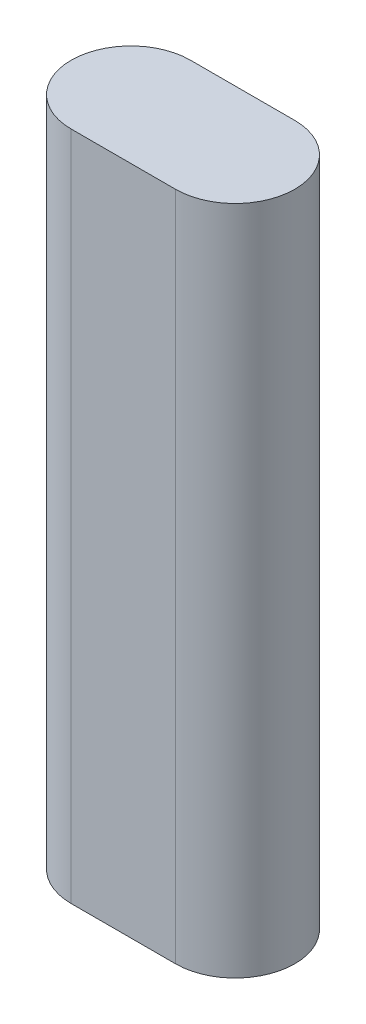
ISO-10303-21;
HEADER;
FILE_DESCRIPTION(('STEP AP214'),'2;1');
FILE_NAME('part.step','',(''),(''),'','','');
FILE_SCHEMA(('AUTOMOTIVE_DESIGN { 1 0 10303 214 1 1 1 1 }'));
ENDSEC;
DATA;
#1=APPLICATION_CONTEXT('core data for automotive mechanical design processes');
#2=APPLICATION_PROTOCOL_DEFINITION('international standard','automotive_design',2000,#1);
#3=PRODUCT_CONTEXT('',#1,'mechanical');
#4=PRODUCT('Part','Part','',(#3));
#5=PRODUCT_RELATED_PRODUCT_CATEGORY('part','',(#4));
#6=PRODUCT_DEFINITION_FORMATION('','',#4);
#7=PRODUCT_DEFINITION_CONTEXT('part definition',#1,'design');
#8=PRODUCT_DEFINITION('design','',#6,#7);
#9=PRODUCT_DEFINITION_SHAPE('','',#8);
#10=(LENGTH_UNIT() NAMED_UNIT(*) SI_UNIT(.MILLI.,.METRE.));
#11=(NAMED_UNIT(*) PLANE_ANGLE_UNIT() SI_UNIT($,.RADIAN.));
#12=(NAMED_UNIT(*) SI_UNIT($,.STERADIAN.) SOLID_ANGLE_UNIT());
#13=UNCERTAINTY_MEASURE_WITH_UNIT(LENGTH_MEASURE(1.E-05),#10,'distance_accuracy_value','');
#14=(GEOMETRIC_REPRESENTATION_CONTEXT(3) GLOBAL_UNCERTAINTY_ASSIGNED_CONTEXT((#13)) GLOBAL_UNIT_ASSIGNED_CONTEXT((#10,
#11,#12)) REPRESENTATION_CONTEXT('',''));
#15=CARTESIAN_POINT('',(0.,0.,0.));
#16=DIRECTION('',(0.,0.,1.));
#17=DIRECTION('',(1.,0.,0.));
#18=AXIS2_PLACEMENT_3D('',#15,#16,#17);
#19=CARTESIAN_POINT('',(-10.5,135.,0.));
#20=DIRECTION('',(0.,-1.,0.));
#21=DIRECTION('',(0.,0.,-1.));
#22=AXIS2_PLACEMENT_3D('',#19,#20,#21);
#23=CYLINDRICAL_SURFACE('',#22,12.);
#24=CARTESIAN_POINT('',(-10.5,0.,0.));
#25=DIRECTION('',(0.,1.,0.));
#26=DIRECTION('',(0.,0.,1.));
#27=AXIS2_PLACEMENT_3D('',#24,#25,#26);
#28=CIRCLE('',#27,12.);
#29=CARTESIAN_POINT('',(-10.5,0.,-12.));
#30=VERTEX_POINT('',#29);
#31=CARTESIAN_POINT('',(-10.5,0.,12.));
#32=VERTEX_POINT('',#31);
#33=EDGE_CURVE('E95',#30,#32,#28,.T.);
#34=ORIENTED_EDGE('',*,*,#33,.T.);
#35=DIRECTION('',(0.,-1.,0.));
#36=VECTOR('',#35,1.);
#37=CARTESIAN_POINT('',(-10.5,135.,12.));
#38=LINE('',#37,#36);
#39=CARTESIAN_POINT('',(-10.5,135.,12.));
#40=VERTEX_POINT('',#39);
#41=EDGE_CURVE('E11',#40,#32,#38,.T.);
#42=ORIENTED_EDGE('',*,*,#41,.F.);
#43=CARTESIAN_POINT('',(-10.5,135.,0.));
#44=DIRECTION('',(0.,1.,0.));
#45=DIRECTION('',(0.,0.,1.));
#46=AXIS2_PLACEMENT_3D('',#43,#44,#45);
#47=CIRCLE('',#46,12.);
#48=CARTESIAN_POINT('',(-10.5,135.,-12.));
#49=VERTEX_POINT('',#48);
#50=EDGE_CURVE('E83',#49,#40,#47,.T.);
#51=ORIENTED_EDGE('',*,*,#50,.F.);
#52=DIRECTION('',(0.,-1.,0.));
#53=VECTOR('',#52,1.);
#54=CARTESIAN_POINT('',(-10.5,135.,-12.));
#55=LINE('',#54,#53);
#56=EDGE_CURVE('E91',#49,#30,#55,.T.);
#57=ORIENTED_EDGE('',*,*,#56,.T.);
#58=EDGE_LOOP('',(#34,#42,#51,#57));
#59=FACE_BOUND('',#58,.T.);
#60=ADVANCED_FACE('F32',(#59),#23,.T.);
#61=CARTESIAN_POINT('',(-10.5,135.,12.));
#62=DIRECTION('',(0.,0.,-1.));
#63=DIRECTION('',(-1.,0.,0.));
#64=AXIS2_PLACEMENT_3D('',#61,#62,#63);
#65=PLANE('',#64);
#66=DIRECTION('',(1.,0.,0.));
#67=VECTOR('',#66,1.);
#68=CARTESIAN_POINT('',(-10.5,0.,12.));
#69=LINE('',#68,#67);
#70=CARTESIAN_POINT('',(10.5,0.,12.));
#71=VERTEX_POINT('',#70);
#72=EDGE_CURVE('E87',#32,#71,#69,.T.);
#73=ORIENTED_EDGE('',*,*,#72,.T.);
#74=DIRECTION('',(0.,-1.,0.));
#75=VECTOR('',#74,1.);
#76=CARTESIAN_POINT('',(10.5,135.,12.));
#77=LINE('',#76,#75);
#78=CARTESIAN_POINT('',(10.5,135.,12.));
#79=VERTEX_POINT('',#78);
#80=EDGE_CURVE('E40',#79,#71,#77,.T.);
#81=ORIENTED_EDGE('',*,*,#80,.F.);
#82=DIRECTION('',(1.,0.,0.));
#83=VECTOR('',#82,1.);
#84=CARTESIAN_POINT('',(-10.5,135.,12.));
#85=LINE('',#84,#83);
#86=EDGE_CURVE('E78',#40,#79,#85,.T.);
#87=ORIENTED_EDGE('',*,*,#86,.F.);
#88=ORIENTED_EDGE('',*,*,#41,.T.);
#89=EDGE_LOOP('',(#73,#81,#87,#88));
#90=FACE_BOUND('',#89,.T.);
#91=ADVANCED_FACE('F86',(#90),#65,.F.);
#92=CARTESIAN_POINT('',(10.5,135.,0.));
#93=DIRECTION('',(0.,-1.,0.));
#94=DIRECTION('',(0.,0.,-1.));
#95=AXIS2_PLACEMENT_3D('',#92,#93,#94);
#96=CYLINDRICAL_SURFACE('',#95,12.);
#97=CARTESIAN_POINT('',(10.5,0.,0.));
#98=DIRECTION('',(0.,1.,0.));
#99=DIRECTION('',(0.,0.,1.));
#100=AXIS2_PLACEMENT_3D('',#97,#98,#99);
#101=CIRCLE('',#100,12.);
#102=CARTESIAN_POINT('',(10.5,0.,-12.));
#103=VERTEX_POINT('',#102);
#104=EDGE_CURVE('E65',#71,#103,#101,.T.);
#105=ORIENTED_EDGE('',*,*,#104,.T.);
#106=DIRECTION('',(0.,-1.,0.));
#107=VECTOR('',#106,1.);
#108=CARTESIAN_POINT('',(10.5,135.,-12.));
#109=LINE('',#108,#107);
#110=CARTESIAN_POINT('',(10.5,135.,-12.));
#111=VERTEX_POINT('',#110);
#112=EDGE_CURVE('E88',#111,#103,#109,.T.);
#113=ORIENTED_EDGE('',*,*,#112,.F.);
#114=CARTESIAN_POINT('',(10.5,135.,0.));
#115=DIRECTION('',(0.,1.,0.));
#116=DIRECTION('',(0.,0.,1.));
#117=AXIS2_PLACEMENT_3D('',#114,#115,#116);
#118=CIRCLE('',#117,12.);
#119=EDGE_CURVE('E81',#79,#111,#118,.T.);
#120=ORIENTED_EDGE('',*,*,#119,.F.);
#121=ORIENTED_EDGE('',*,*,#80,.T.);
#122=EDGE_LOOP('',(#105,#113,#120,#121));
#123=FACE_BOUND('',#122,.T.);
#124=ADVANCED_FACE('F89',(#123),#96,.T.);
#125=CARTESIAN_POINT('',(-10.5,135.,-12.));
#126=DIRECTION('',(0.,0.,1.));
#127=DIRECTION('',(1.,0.,0.));
#128=AXIS2_PLACEMENT_3D('',#125,#126,#127);
#129=PLANE('',#128);
#130=DIRECTION('',(-1.,0.,0.));
#131=VECTOR('',#130,1.);
#132=CARTESIAN_POINT('',(-10.5,0.,-12.));
#133=LINE('',#132,#131);
#134=EDGE_CURVE('E71',#103,#30,#133,.T.);
#135=ORIENTED_EDGE('',*,*,#134,.T.);
#136=ORIENTED_EDGE('',*,*,#56,.F.);
#137=DIRECTION('',(-1.,0.,0.));
#138=VECTOR('',#137,1.);
#139=CARTESIAN_POINT('',(-10.5,135.,-12.));
#140=LINE('',#139,#138);
#141=EDGE_CURVE('E48',#111,#49,#140,.T.);
#142=ORIENTED_EDGE('',*,*,#141,.F.);
#143=ORIENTED_EDGE('',*,*,#112,.T.);
#144=EDGE_LOOP('',(#135,#136,#142,#143));
#145=FACE_BOUND('',#144,.T.);
#146=ADVANCED_FACE('F102',(#145),#129,.F.);
#147=CARTESIAN_POINT('',(-10.5,135.,0.));
#148=DIRECTION('',(0.,1.,0.));
#149=DIRECTION('',(0.,0.,1.));
#150=AXIS2_PLACEMENT_3D('',#147,#148,#149);
#151=PLANE('',#150);
#152=ORIENTED_EDGE('',*,*,#50,.T.);
#153=ORIENTED_EDGE('',*,*,#86,.T.);
#154=ORIENTED_EDGE('',*,*,#119,.T.);
#155=ORIENTED_EDGE('',*,*,#141,.T.);
#156=EDGE_LOOP('',(#152,#153,#154,#155));
#157=FACE_BOUND('',#156,.T.);
#158=ADVANCED_FACE('F79',(#157),#151,.T.);
#159=CARTESIAN_POINT('',(-10.5,0.,0.));
#160=DIRECTION('',(0.,1.,0.));
#161=DIRECTION('',(0.,0.,1.));
#162=AXIS2_PLACEMENT_3D('',#159,#160,#161);
#163=PLANE('',#162);
#164=ORIENTED_EDGE('',*,*,#33,.F.);
#165=ORIENTED_EDGE('',*,*,#134,.F.);
#166=ORIENTED_EDGE('',*,*,#104,.F.);
#167=ORIENTED_EDGE('',*,*,#72,.F.);
#168=EDGE_LOOP('',(#164,#165,#166,#167));
#169=FACE_BOUND('',#168,.T.);
#170=ADVANCED_FACE('F105',(#169),#163,.F.);
#171=CLOSED_SHELL('',(#60,#91,#124,#146,#158,#170));
#172=MANIFOLD_SOLID_BREP('B2',#171);
#173=ADVANCED_BREP_SHAPE_REPRESENTATION('',(#18,#172),#14);
#174=SHAPE_DEFINITION_REPRESENTATION(#9,#173);
ENDSEC;
END-ISO-10303-21;
